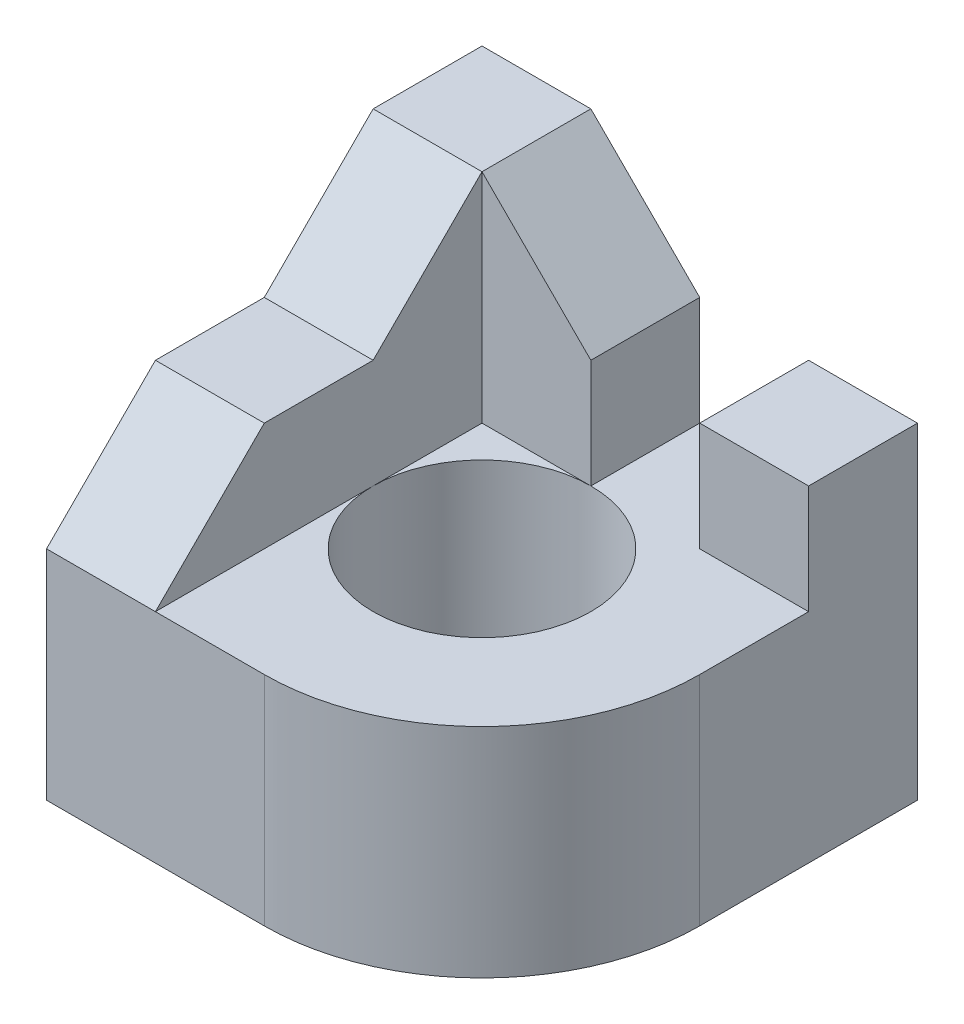
ISO-10303-21;
HEADER;
FILE_DESCRIPTION(('STEP AP214'),'2;1');
FILE_NAME('part.step','',(''),(''),'','','');
FILE_SCHEMA(('AUTOMOTIVE_DESIGN { 1 0 10303 214 1 1 1 1 }'));
ENDSEC;
DATA;
#1=APPLICATION_CONTEXT('core data for automotive mechanical design processes');
#2=APPLICATION_PROTOCOL_DEFINITION('international standard','automotive_design',2000,#1);
#3=PRODUCT_CONTEXT('',#1,'mechanical');
#4=PRODUCT('Part','Part','',(#3));
#5=PRODUCT_RELATED_PRODUCT_CATEGORY('part','',(#4));
#6=PRODUCT_DEFINITION_FORMATION('','',#4);
#7=PRODUCT_DEFINITION_CONTEXT('part definition',#1,'design');
#8=PRODUCT_DEFINITION('design','',#6,#7);
#9=PRODUCT_DEFINITION_SHAPE('','',#8);
#10=(LENGTH_UNIT() NAMED_UNIT(*) SI_UNIT(.MILLI.,.METRE.));
#11=(NAMED_UNIT(*) PLANE_ANGLE_UNIT() SI_UNIT($,.RADIAN.));
#12=(NAMED_UNIT(*) SI_UNIT($,.STERADIAN.) SOLID_ANGLE_UNIT());
#13=UNCERTAINTY_MEASURE_WITH_UNIT(LENGTH_MEASURE(1.E-05),#10,'distance_accuracy_value','');
#14=(GEOMETRIC_REPRESENTATION_CONTEXT(3) GLOBAL_UNCERTAINTY_ASSIGNED_CONTEXT((#13)) GLOBAL_UNIT_ASSIGNED_CONTEXT((#10,
#11,#12)) REPRESENTATION_CONTEXT('',''));
#15=CARTESIAN_POINT('',(0.,0.,0.));
#16=DIRECTION('',(0.,0.,1.));
#17=DIRECTION('',(1.,0.,0.));
#18=AXIS2_PLACEMENT_3D('',#15,#16,#17);
#19=CARTESIAN_POINT('',(0.,40.,0.));
#20=DIRECTION('',(0.,1.,0.));
#21=DIRECTION('',(0.,0.,1.));
#22=AXIS2_PLACEMENT_3D('',#19,#20,#21);
#23=PLANE('',#22);
#24=DIRECTION('',(0.,0.,1.));
#25=VECTOR('',#24,1.);
#26=CARTESIAN_POINT('',(0.,40.,0.));
#27=LINE('',#26,#25);
#28=CARTESIAN_POINT('',(0.,40.,0.));
#29=VERTEX_POINT('',#28);
#30=CARTESIAN_POINT('',(0.,40.,10.));
#31=VERTEX_POINT('',#30);
#32=EDGE_CURVE('E189',#29,#31,#27,.T.);
#33=ORIENTED_EDGE('',*,*,#32,.T.);
#34=DIRECTION('',(-1.,0.,0.));
#35=VECTOR('',#34,1.);
#36=CARTESIAN_POINT('',(109.102540378444,40.,10.));
#37=LINE('',#36,#35);
#38=CARTESIAN_POINT('',(9.99999999999999,40.,10.));
#39=VERTEX_POINT('',#38);
#40=EDGE_CURVE('E161',#39,#31,#37,.T.);
#41=ORIENTED_EDGE('',*,*,#40,.F.);
#42=DIRECTION('',(0.,0.,-1.));
#43=VECTOR('',#42,1.);
#44=CARTESIAN_POINT('',(10.,40.,109.102540378444));
#45=LINE('',#44,#43);
#46=CARTESIAN_POINT('',(10.,40.,0.));
#47=VERTEX_POINT('',#46);
#48=EDGE_CURVE('E185',#39,#47,#45,.T.);
#49=ORIENTED_EDGE('',*,*,#48,.T.);
#50=DIRECTION('',(-1.,0.,0.));
#51=VECTOR('',#50,1.);
#52=CARTESIAN_POINT('',(0.,40.,0.));
#53=LINE('',#52,#51);
#54=EDGE_CURVE('E187',#47,#29,#53,.T.);
#55=ORIENTED_EDGE('',*,*,#54,.T.);
#56=EDGE_LOOP('',(#33,#41,#49,#55));
#57=FACE_BOUND('',#56,.T.);
#58=ADVANCED_FACE('F33',(#57),#23,.T.);
#59=CARTESIAN_POINT('',(0.,20.,40.));
#60=DIRECTION('',(0.,0.,-1.));
#61=DIRECTION('',(-1.,0.,0.));
#62=AXIS2_PLACEMENT_3D('',#59,#60,#61);
#63=PLANE('',#62);
#64=DIRECTION('',(-1.,0.,0.));
#65=VECTOR('',#64,1.);
#66=CARTESIAN_POINT('',(109.102540378444,20.,40.));
#67=LINE('',#66,#65);
#68=CARTESIAN_POINT('',(10.,20.,40.));
#69=VERTEX_POINT('',#68);
#70=CARTESIAN_POINT('',(0.,20.,40.));
#71=VERTEX_POINT('',#70);
#72=EDGE_CURVE('E162',#69,#71,#67,.T.);
#73=ORIENTED_EDGE('',*,*,#72,.T.);
#74=DIRECTION('',(0.,-1.,0.));
#75=VECTOR('',#74,1.);
#76=CARTESIAN_POINT('',(0.,20.,40.));
#77=LINE('',#76,#75);
#78=CARTESIAN_POINT('',(0.,0.,40.));
#79=VERTEX_POINT('',#78);
#80=EDGE_CURVE('E167',#71,#79,#77,.T.);
#81=ORIENTED_EDGE('',*,*,#80,.T.);
#82=DIRECTION('',(1.,0.,0.));
#83=VECTOR('',#82,1.);
#84=CARTESIAN_POINT('',(0.,0.,40.));
#85=LINE('',#84,#83);
#86=CARTESIAN_POINT('',(20.,0.,40.));
#87=VERTEX_POINT('',#86);
#88=EDGE_CURVE('E251',#79,#87,#85,.T.);
#89=ORIENTED_EDGE('',*,*,#88,.T.);
#90=DIRECTION('',(0.,-1.,0.));
#91=VECTOR('',#90,1.);
#92=CARTESIAN_POINT('',(20.,20.,40.));
#93=LINE('',#92,#91);
#94=CARTESIAN_POINT('',(20.,20.,40.));
#95=VERTEX_POINT('',#94);
#96=EDGE_CURVE('E259',#95,#87,#93,.T.);
#97=ORIENTED_EDGE('',*,*,#96,.F.);
#98=DIRECTION('',(1.,0.,0.));
#99=VECTOR('',#98,1.);
#100=CARTESIAN_POINT('',(0.,20.,40.));
#101=LINE('',#100,#99);
#102=EDGE_CURVE('E237',#69,#95,#101,.T.);
#103=ORIENTED_EDGE('',*,*,#102,.F.);
#104=EDGE_LOOP('',(#73,#81,#89,#97,#103));
#105=FACE_BOUND('',#104,.T.);
#106=ADVANCED_FACE('F276',(#105),#63,.F.);
#107=CARTESIAN_POINT('',(9.99999999999999,40.,0.));
#108=DIRECTION('',(1.,0.,0.));
#109=DIRECTION('',(0.,0.,-1.));
#110=AXIS2_PLACEMENT_3D('',#107,#108,#109);
#111=PLANE('',#110);
#112=DIRECTION('',(0.,-1.,0.));
#113=VECTOR('',#112,1.);
#114=CARTESIAN_POINT('',(10.,40.,10.));
#115=LINE('',#114,#113);
#116=CARTESIAN_POINT('',(10.,20.,10.));
#117=VERTEX_POINT('',#116);
#118=EDGE_CURVE('E192',#39,#117,#115,.T.);
#119=ORIENTED_EDGE('',*,*,#118,.F.);
#120=DIRECTION('',(0.,0.707106781186548,-0.707106781186548));
#121=VECTOR('',#120,1.);
#122=CARTESIAN_POINT('',(9.99999999999999,30.,20.));
#123=LINE('',#122,#121);
#124=CARTESIAN_POINT('',(9.99999999999999,30.,20.));
#125=VERTEX_POINT('',#124);
#126=EDGE_CURVE('E176',#125,#39,#123,.T.);
#127=ORIENTED_EDGE('',*,*,#126,.F.);
#128=DIRECTION('',(0.,0.,-1.));
#129=VECTOR('',#128,1.);
#130=CARTESIAN_POINT('',(9.99999999999999,30.,30.));
#131=LINE('',#130,#129);
#132=CARTESIAN_POINT('',(9.99999999999999,30.,30.));
#133=VERTEX_POINT('',#132);
#134=EDGE_CURVE('E178',#133,#125,#131,.T.);
#135=ORIENTED_EDGE('',*,*,#134,.F.);
#136=DIRECTION('',(0.,0.707106781186547,-0.707106781186548));
#137=VECTOR('',#136,1.);
#138=CARTESIAN_POINT('',(9.99999999999999,20.,40.));
#139=LINE('',#138,#137);
#140=EDGE_CURVE('E160',#69,#133,#139,.T.);
#141=ORIENTED_EDGE('',*,*,#140,.F.);
#142=DIRECTION('',(0.,0.,-1.));
#143=VECTOR('',#142,1.);
#144=CARTESIAN_POINT('',(9.99999999999999,20.,0.));
#145=LINE('',#144,#143);
#146=CARTESIAN_POINT('',(10.,20.,20.));
#147=VERTEX_POINT('',#146);
#148=EDGE_CURVE('E200',#69,#147,#145,.T.);
#149=ORIENTED_EDGE('',*,*,#148,.T.);
#150=EDGE_CURVE('E56',#147,#117,#145,.T.);
#151=ORIENTED_EDGE('',*,*,#150,.T.);
#152=EDGE_LOOP('',(#119,#127,#135,#141,#149,#151));
#153=FACE_BOUND('',#152,.T.);
#154=ADVANCED_FACE('F290',(#153),#111,.T.);
#155=CARTESIAN_POINT('',(0.,20.,0.));
#156=DIRECTION('',(0.,0.,1.));
#157=DIRECTION('',(1.,0.,0.));
#158=AXIS2_PLACEMENT_3D('',#155,#156,#157);
#159=PLANE('',#158);
#160=DIRECTION('',(-0.707106781186548,0.707106781186548,0.));
#161=VECTOR('',#160,1.);
#162=CARTESIAN_POINT('',(10.,40.,0.));
#163=LINE('',#162,#161);
#164=CARTESIAN_POINT('',(20.,30.,0.));
#165=VERTEX_POINT('',#164);
#166=EDGE_CURVE('E48',#165,#47,#163,.T.);
#167=ORIENTED_EDGE('',*,*,#166,.F.);
#168=DIRECTION('',(0.,-1.,0.));
#169=VECTOR('',#168,1.);
#170=CARTESIAN_POINT('',(20.,40.,0.));
#171=LINE('',#170,#169);
#172=CARTESIAN_POINT('',(20.,20.,0.));
#173=VERTEX_POINT('',#172);
#174=EDGE_CURVE('E195',#165,#173,#171,.T.);
#175=ORIENTED_EDGE('',*,*,#174,.T.);
#176=DIRECTION('',(-1.,0.,0.));
#177=VECTOR('',#176,1.);
#178=CARTESIAN_POINT('',(0.,20.,0.));
#179=LINE('',#178,#177);
#180=CARTESIAN_POINT('',(30.,20.,0.));
#181=VERTEX_POINT('',#180);
#182=EDGE_CURVE('E233',#181,#173,#179,.T.);
#183=ORIENTED_EDGE('',*,*,#182,.F.);
#184=DIRECTION('',(0.,-1.,0.));
#185=VECTOR('',#184,1.);
#186=CARTESIAN_POINT('',(30.,30.,0.));
#187=LINE('',#186,#185);
#188=CARTESIAN_POINT('',(30.,30.,0.));
#189=VERTEX_POINT('',#188);
#190=EDGE_CURVE('E216',#189,#181,#187,.T.);
#191=ORIENTED_EDGE('',*,*,#190,.F.);
#192=DIRECTION('',(-1.,0.,0.));
#193=VECTOR('',#192,1.);
#194=CARTESIAN_POINT('',(0.,30.,0.));
#195=LINE('',#194,#193);
#196=CARTESIAN_POINT('',(40.,30.,0.));
#197=VERTEX_POINT('',#196);
#198=EDGE_CURVE('E214',#197,#189,#195,.T.);
#199=ORIENTED_EDGE('',*,*,#198,.F.);
#200=DIRECTION('',(0.,-1.,0.));
#201=VECTOR('',#200,1.);
#202=CARTESIAN_POINT('',(40.,20.,0.));
#203=LINE('',#202,#201);
#204=CARTESIAN_POINT('',(40.,0.,0.));
#205=VERTEX_POINT('',#204);
#206=EDGE_CURVE('E11',#197,#205,#203,.T.);
#207=ORIENTED_EDGE('',*,*,#206,.T.);
#208=DIRECTION('',(-1.,0.,0.));
#209=VECTOR('',#208,1.);
#210=CARTESIAN_POINT('',(0.,0.,0.));
#211=LINE('',#210,#209);
#212=CARTESIAN_POINT('',(0.,0.,0.));
#213=VERTEX_POINT('',#212);
#214=EDGE_CURVE('E247',#205,#213,#211,.T.);
#215=ORIENTED_EDGE('',*,*,#214,.T.);
#216=DIRECTION('',(0.,-1.,0.));
#217=VECTOR('',#216,1.);
#218=CARTESIAN_POINT('',(0.,20.,0.));
#219=LINE('',#218,#217);
#220=EDGE_CURVE('E41',#29,#213,#219,.T.);
#221=ORIENTED_EDGE('',*,*,#220,.F.);
#222=ORIENTED_EDGE('',*,*,#54,.F.);
#223=EDGE_LOOP('',(#167,#175,#183,#191,#199,#207,#215,#221,#222));
#224=FACE_BOUND('',#223,.T.);
#225=ADVANCED_FACE('F305',(#224),#159,.F.);
#226=CARTESIAN_POINT('',(0.,40.,10.));
#227=DIRECTION('',(0.,0.,-1.));
#228=DIRECTION('',(-1.,0.,0.));
#229=AXIS2_PLACEMENT_3D('',#226,#227,#228);
#230=PLANE('',#229);
#231=DIRECTION('',(-0.707106781186548,0.707106781186548,0.));
#232=VECTOR('',#231,1.);
#233=CARTESIAN_POINT('',(10.,40.,10.));
#234=LINE('',#233,#232);
#235=CARTESIAN_POINT('',(20.,30.,10.));
#236=VERTEX_POINT('',#235);
#237=EDGE_CURVE('E181',#236,#39,#234,.T.);
#238=ORIENTED_EDGE('',*,*,#237,.T.);
#239=ORIENTED_EDGE('',*,*,#118,.T.);
#240=DIRECTION('',(-1.,0.,0.));
#241=VECTOR('',#240,1.);
#242=CARTESIAN_POINT('',(0.,20.,10.));
#243=LINE('',#242,#241);
#244=CARTESIAN_POINT('',(20.,20.,10.));
#245=VERTEX_POINT('',#244);
#246=EDGE_CURVE('E204',#245,#117,#243,.T.);
#247=ORIENTED_EDGE('',*,*,#246,.F.);
#248=DIRECTION('',(0.,-1.,0.));
#249=VECTOR('',#248,1.);
#250=CARTESIAN_POINT('',(20.,40.,10.));
#251=LINE('',#250,#249);
#252=EDGE_CURVE('E197',#236,#245,#251,.T.);
#253=ORIENTED_EDGE('',*,*,#252,.F.);
#254=EDGE_LOOP('',(#238,#239,#247,#253));
#255=FACE_BOUND('',#254,.T.);
#256=ADVANCED_FACE('F297',(#255),#230,.F.);
#257=CARTESIAN_POINT('',(20.,40.,0.));
#258=DIRECTION('',(-1.,0.,0.));
#259=DIRECTION('',(0.,0.,1.));
#260=AXIS2_PLACEMENT_3D('',#257,#258,#259);
#261=PLANE('',#260);
#262=DIRECTION('',(0.,0.,-1.));
#263=VECTOR('',#262,1.);
#264=CARTESIAN_POINT('',(20.,30.,109.102540378444));
#265=LINE('',#264,#263);
#266=EDGE_CURVE('E180',#236,#165,#265,.T.);
#267=ORIENTED_EDGE('',*,*,#266,.F.);
#268=ORIENTED_EDGE('',*,*,#252,.T.);
#269=DIRECTION('',(0.,0.,1.));
#270=VECTOR('',#269,1.);
#271=CARTESIAN_POINT('',(20.,20.,0.));
#272=LINE('',#271,#270);
#273=EDGE_CURVE('E201',#173,#245,#272,.T.);
#274=ORIENTED_EDGE('',*,*,#273,.F.);
#275=ORIENTED_EDGE('',*,*,#174,.F.);
#276=EDGE_LOOP('',(#267,#268,#274,#275));
#277=FACE_BOUND('',#276,.T.);
#278=ADVANCED_FACE('F303',(#277),#261,.F.);
#279=CARTESIAN_POINT('',(0.,20.,0.));
#280=DIRECTION('',(0.,1.,0.));
#281=DIRECTION('',(0.,0.,1.));
#282=AXIS2_PLACEMENT_3D('',#279,#280,#281);
#283=PLANE('',#282);
#284=ORIENTED_EDGE('',*,*,#182,.T.);
#285=ORIENTED_EDGE('',*,*,#273,.T.);
#286=CARTESIAN_POINT('',(20.,20.,20.));
#287=DIRECTION('',(0.,1.,0.));
#288=DIRECTION('',(0.,0.,1.));
#289=AXIS2_PLACEMENT_3D('',#286,#287,#288);
#290=CIRCLE('',#289,10.);
#291=EDGE_CURVE('E241',#147,#245,#290,.T.);
#292=ORIENTED_EDGE('',*,*,#291,.F.);
#293=ORIENTED_EDGE('',*,*,#148,.F.);
#294=ORIENTED_EDGE('',*,*,#102,.T.);
#295=CARTESIAN_POINT('',(20.,20.,20.));
#296=DIRECTION('',(0.,1.,0.));
#297=DIRECTION('',(0.,0.,1.));
#298=AXIS2_PLACEMENT_3D('',#295,#296,#297);
#299=CIRCLE('',#298,20.);
#300=CARTESIAN_POINT('',(40.,20.,20.));
#301=VERTEX_POINT('',#300);
#302=EDGE_CURVE('E239',#95,#301,#299,.T.);
#303=ORIENTED_EDGE('',*,*,#302,.T.);
#304=DIRECTION('',(0.,0.,-1.));
#305=VECTOR('',#304,1.);
#306=CARTESIAN_POINT('',(40.,20.,0.));
#307=LINE('',#306,#305);
#308=CARTESIAN_POINT('',(40.,20.,10.));
#309=VERTEX_POINT('',#308);
#310=EDGE_CURVE('E231',#301,#309,#307,.T.);
#311=ORIENTED_EDGE('',*,*,#310,.T.);
#312=DIRECTION('',(-1.,0.,0.));
#313=VECTOR('',#312,1.);
#314=CARTESIAN_POINT('',(0.,20.,10.));
#315=LINE('',#314,#313);
#316=CARTESIAN_POINT('',(30.,20.,10.));
#317=VERTEX_POINT('',#316);
#318=EDGE_CURVE('E225',#309,#317,#315,.T.);
#319=ORIENTED_EDGE('',*,*,#318,.T.);
#320=DIRECTION('',(0.,0.,1.));
#321=VECTOR('',#320,1.);
#322=CARTESIAN_POINT('',(30.,20.,0.));
#323=LINE('',#322,#321);
#324=EDGE_CURVE('E227',#181,#317,#323,.T.);
#325=ORIENTED_EDGE('',*,*,#324,.F.);
#326=EDGE_LOOP('',(#284,#285,#292,#293,#294,#303,#311,#319,#325));
#327=FACE_BOUND('',#326,.T.);
#328=ADVANCED_FACE('F284',(#327),#283,.T.);
#329=EDGE_CURVE('E242',#245,#147,#290,.T.);
#330=ORIENTED_EDGE('',*,*,#329,.F.);
#331=ORIENTED_EDGE('',*,*,#246,.T.);
#332=ORIENTED_EDGE('',*,*,#150,.F.);
#333=EDGE_LOOP('',(#330,#331,#332));
#334=FACE_BOUND('',#333,.T.);
#335=ADVANCED_FACE('F362',(#334),#283,.T.);
#336=CARTESIAN_POINT('',(40.,20.,0.));
#337=DIRECTION('',(-1.,0.,0.));
#338=DIRECTION('',(0.,0.,1.));
#339=AXIS2_PLACEMENT_3D('',#336,#337,#338);
#340=PLANE('',#339);
#341=ORIENTED_EDGE('',*,*,#206,.F.);
#342=DIRECTION('',(0.,0.,-1.));
#343=VECTOR('',#342,1.);
#344=CARTESIAN_POINT('',(40.,30.,0.));
#345=LINE('',#344,#343);
#346=CARTESIAN_POINT('',(40.,30.,10.));
#347=VERTEX_POINT('',#346);
#348=EDGE_CURVE('E211',#347,#197,#345,.T.);
#349=ORIENTED_EDGE('',*,*,#348,.F.);
#350=DIRECTION('',(0.,-1.,0.));
#351=VECTOR('',#350,1.);
#352=CARTESIAN_POINT('',(40.,30.,10.));
#353=LINE('',#352,#351);
#354=EDGE_CURVE('E219',#347,#309,#353,.T.);
#355=ORIENTED_EDGE('',*,*,#354,.T.);
#356=ORIENTED_EDGE('',*,*,#310,.F.);
#357=DIRECTION('',(0.,-1.,0.));
#358=VECTOR('',#357,1.);
#359=CARTESIAN_POINT('',(40.,20.,20.));
#360=LINE('',#359,#358);
#361=CARTESIAN_POINT('',(40.,0.,20.));
#362=VERTEX_POINT('',#361);
#363=EDGE_CURVE('E245',#301,#362,#360,.T.);
#364=ORIENTED_EDGE('',*,*,#363,.T.);
#365=DIRECTION('',(0.,0.,-1.));
#366=VECTOR('',#365,1.);
#367=CARTESIAN_POINT('',(40.,0.,0.));
#368=LINE('',#367,#366);
#369=EDGE_CURVE('E230',#362,#205,#368,.T.);
#370=ORIENTED_EDGE('',*,*,#369,.T.);
#371=EDGE_LOOP('',(#341,#349,#355,#356,#364,#370));
#372=FACE_BOUND('',#371,.T.);
#373=ADVANCED_FACE('F35',(#372),#340,.F.);
#374=CARTESIAN_POINT('',(0.,20.,0.));
#375=DIRECTION('',(1.,0.,0.));
#376=DIRECTION('',(0.,0.,-1.));
#377=AXIS2_PLACEMENT_3D('',#374,#375,#376);
#378=PLANE('',#377);
#379=ORIENTED_EDGE('',*,*,#80,.F.);
#380=DIRECTION('',(0.,0.707106781186547,-0.707106781186548));
#381=VECTOR('',#380,1.);
#382=CARTESIAN_POINT('',(0.,20.,40.));
#383=LINE('',#382,#381);
#384=CARTESIAN_POINT('',(0.,30.,30.));
#385=VERTEX_POINT('',#384);
#386=EDGE_CURVE('E154',#71,#385,#383,.T.);
#387=ORIENTED_EDGE('',*,*,#386,.T.);
#388=DIRECTION('',(0.,0.,-1.));
#389=VECTOR('',#388,1.);
#390=CARTESIAN_POINT('',(0.,30.,30.));
#391=LINE('',#390,#389);
#392=CARTESIAN_POINT('',(0.,30.,20.));
#393=VERTEX_POINT('',#392);
#394=EDGE_CURVE('E143',#385,#393,#391,.T.);
#395=ORIENTED_EDGE('',*,*,#394,.T.);
#396=DIRECTION('',(0.,0.707106781186548,-0.707106781186548));
#397=VECTOR('',#396,1.);
#398=CARTESIAN_POINT('',(0.,30.,20.));
#399=LINE('',#398,#397);
#400=EDGE_CURVE('E153',#393,#31,#399,.T.);
#401=ORIENTED_EDGE('',*,*,#400,.T.);
#402=ORIENTED_EDGE('',*,*,#32,.F.);
#403=ORIENTED_EDGE('',*,*,#220,.T.);
#404=DIRECTION('',(0.,0.,1.));
#405=VECTOR('',#404,1.);
#406=CARTESIAN_POINT('',(0.,0.,0.));
#407=LINE('',#406,#405);
#408=EDGE_CURVE('E249',#213,#79,#407,.T.);
#409=ORIENTED_EDGE('',*,*,#408,.T.);
#410=EDGE_LOOP('',(#379,#387,#395,#401,#402,#403,#409));
#411=FACE_BOUND('',#410,.T.);
#412=ADVANCED_FACE('F165',(#411),#378,.F.);
#413=CARTESIAN_POINT('',(20.,20.,20.));
#414=DIRECTION('',(0.,-1.,0.));
#415=DIRECTION('',(0.,0.,-1.));
#416=AXIS2_PLACEMENT_3D('',#413,#414,#415);
#417=CYLINDRICAL_SURFACE('',#416,20.);
#418=CARTESIAN_POINT('',(20.,0.,20.));
#419=DIRECTION('',(0.,1.,0.));
#420=DIRECTION('',(0.,0.,1.));
#421=AXIS2_PLACEMENT_3D('',#418,#419,#420);
#422=CIRCLE('',#421,20.);
#423=EDGE_CURVE('E253',#87,#362,#422,.T.);
#424=ORIENTED_EDGE('',*,*,#423,.T.);
#425=ORIENTED_EDGE('',*,*,#363,.F.);
#426=ORIENTED_EDGE('',*,*,#302,.F.);
#427=ORIENTED_EDGE('',*,*,#96,.T.);
#428=EDGE_LOOP('',(#424,#425,#426,#427));
#429=FACE_BOUND('',#428,.T.);
#430=ADVANCED_FACE('F280',(#429),#417,.T.);
#431=CARTESIAN_POINT('',(20.,20.,20.));
#432=DIRECTION('',(0.,-1.,0.));
#433=DIRECTION('',(0.,0.,-1.));
#434=AXIS2_PLACEMENT_3D('',#431,#432,#433);
#435=CYLINDRICAL_SURFACE('',#434,10.);
#436=CARTESIAN_POINT('',(20.,0.,20.));
#437=DIRECTION('',(0.,1.,0.));
#438=DIRECTION('',(0.,0.,1.));
#439=AXIS2_PLACEMENT_3D('',#436,#437,#438);
#440=CIRCLE('',#439,10.);
#441=CARTESIAN_POINT('',(20.,0.,30.));
#442=VERTEX_POINT('',#441);
#443=EDGE_CURVE('E234',#442,#442,#440,.T.);
#444=ORIENTED_EDGE('',*,*,#443,.F.);
#445=EDGE_LOOP('',(#444));
#446=FACE_BOUND('',#445,.T.);
#447=ORIENTED_EDGE('',*,*,#291,.T.);
#448=ORIENTED_EDGE('',*,*,#329,.T.);
#449=EDGE_LOOP('',(#447,#448));
#450=FACE_BOUND('',#449,.T.);
#451=ADVANCED_FACE('F354',(#446,#450),#435,.F.);
#452=CARTESIAN_POINT('',(0.,0.,0.));
#453=DIRECTION('',(0.,1.,0.));
#454=DIRECTION('',(0.,0.,1.));
#455=AXIS2_PLACEMENT_3D('',#452,#453,#454);
#456=PLANE('',#455);
#457=ORIENTED_EDGE('',*,*,#443,.T.);
#458=EDGE_LOOP('',(#457));
#459=FACE_BOUND('',#458,.T.);
#460=ORIENTED_EDGE('',*,*,#408,.F.);
#461=ORIENTED_EDGE('',*,*,#214,.F.);
#462=ORIENTED_EDGE('',*,*,#369,.F.);
#463=ORIENTED_EDGE('',*,*,#423,.F.);
#464=ORIENTED_EDGE('',*,*,#88,.F.);
#465=EDGE_LOOP('',(#460,#461,#462,#463,#464));
#466=FACE_BOUND('',#465,.T.);
#467=ADVANCED_FACE('F271',(#459,#466),#456,.F.);
#468=CARTESIAN_POINT('',(30.,30.,0.));
#469=DIRECTION('',(-1.,0.,0.));
#470=DIRECTION('',(0.,0.,1.));
#471=AXIS2_PLACEMENT_3D('',#468,#469,#470);
#472=PLANE('',#471);
#473=ORIENTED_EDGE('',*,*,#190,.T.);
#474=ORIENTED_EDGE('',*,*,#324,.T.);
#475=DIRECTION('',(0.,-1.,0.));
#476=VECTOR('',#475,1.);
#477=CARTESIAN_POINT('',(30.,30.,10.));
#478=LINE('',#477,#476);
#479=CARTESIAN_POINT('',(30.,30.,10.));
#480=VERTEX_POINT('',#479);
#481=EDGE_CURVE('E222',#480,#317,#478,.T.);
#482=ORIENTED_EDGE('',*,*,#481,.F.);
#483=DIRECTION('',(0.,0.,-1.));
#484=VECTOR('',#483,1.);
#485=CARTESIAN_POINT('',(30.,30.,0.));
#486=LINE('',#485,#484);
#487=EDGE_CURVE('E206',#480,#189,#486,.T.);
#488=ORIENTED_EDGE('',*,*,#487,.T.);
#489=EDGE_LOOP('',(#473,#474,#482,#488));
#490=FACE_BOUND('',#489,.T.);
#491=ADVANCED_FACE('F310',(#490),#472,.T.);
#492=CARTESIAN_POINT('',(0.,30.,10.));
#493=DIRECTION('',(0.,0.,-1.));
#494=DIRECTION('',(-1.,0.,0.));
#495=AXIS2_PLACEMENT_3D('',#492,#493,#494);
#496=PLANE('',#495);
#497=ORIENTED_EDGE('',*,*,#318,.F.);
#498=ORIENTED_EDGE('',*,*,#354,.F.);
#499=DIRECTION('',(1.,0.,0.));
#500=VECTOR('',#499,1.);
#501=CARTESIAN_POINT('',(0.,30.,10.));
#502=LINE('',#501,#500);
#503=EDGE_CURVE('E209',#480,#347,#502,.T.);
#504=ORIENTED_EDGE('',*,*,#503,.F.);
#505=ORIENTED_EDGE('',*,*,#481,.T.);
#506=EDGE_LOOP('',(#497,#498,#504,#505));
#507=FACE_BOUND('',#506,.T.);
#508=ADVANCED_FACE('F320',(#507),#496,.F.);
#509=CARTESIAN_POINT('',(0.,30.,0.));
#510=DIRECTION('',(0.,1.,0.));
#511=DIRECTION('',(0.,0.,1.));
#512=AXIS2_PLACEMENT_3D('',#509,#510,#511);
#513=PLANE('',#512);
#514=ORIENTED_EDGE('',*,*,#487,.F.);
#515=ORIENTED_EDGE('',*,*,#503,.T.);
#516=ORIENTED_EDGE('',*,*,#348,.T.);
#517=ORIENTED_EDGE('',*,*,#198,.T.);
#518=EDGE_LOOP('',(#514,#515,#516,#517));
#519=FACE_BOUND('',#518,.T.);
#520=ADVANCED_FACE('F314',(#519),#513,.T.);
#521=CARTESIAN_POINT('',(10.,40.,109.102540378444));
#522=DIRECTION('',(0.707106781186548,0.707106781186548,0.));
#523=DIRECTION('',(-0.707106781186548,0.707106781186548,0.));
#524=AXIS2_PLACEMENT_3D('',#521,#522,#523);
#525=PLANE('',#524);
#526=ORIENTED_EDGE('',*,*,#237,.F.);
#527=ORIENTED_EDGE('',*,*,#266,.T.);
#528=ORIENTED_EDGE('',*,*,#166,.T.);
#529=ORIENTED_EDGE('',*,*,#48,.F.);
#530=EDGE_LOOP('',(#526,#527,#528,#529));
#531=FACE_BOUND('',#530,.T.);
#532=ADVANCED_FACE('F300',(#531),#525,.T.);
#533=CARTESIAN_POINT('',(109.102540378444,30.,20.));
#534=DIRECTION('',(0.,0.707106781186548,0.707106781186548));
#535=DIRECTION('',(0.,-0.707106781186548,0.707106781186548));
#536=AXIS2_PLACEMENT_3D('',#533,#534,#535);
#537=PLANE('',#536);
#538=DIRECTION('',(-1.,0.,0.));
#539=VECTOR('',#538,1.);
#540=CARTESIAN_POINT('',(109.102540378444,30.,20.));
#541=LINE('',#540,#539);
#542=EDGE_CURVE('E149',#125,#393,#541,.T.);
#543=ORIENTED_EDGE('',*,*,#542,.F.);
#544=ORIENTED_EDGE('',*,*,#126,.T.);
#545=ORIENTED_EDGE('',*,*,#40,.T.);
#546=ORIENTED_EDGE('',*,*,#400,.F.);
#547=EDGE_LOOP('',(#543,#544,#545,#546));
#548=FACE_BOUND('',#547,.T.);
#549=ADVANCED_FACE('F293',(#548),#537,.T.);
#550=CARTESIAN_POINT('',(109.102540378444,30.,30.));
#551=DIRECTION('',(0.,1.,0.));
#552=DIRECTION('',(0.,0.,1.));
#553=AXIS2_PLACEMENT_3D('',#550,#551,#552);
#554=PLANE('',#553);
#555=DIRECTION('',(-1.,0.,0.));
#556=VECTOR('',#555,1.);
#557=CARTESIAN_POINT('',(109.102540378444,30.,30.));
#558=LINE('',#557,#556);
#559=EDGE_CURVE('E146',#133,#385,#558,.T.);
#560=ORIENTED_EDGE('',*,*,#559,.F.);
#561=ORIENTED_EDGE('',*,*,#134,.T.);
#562=ORIENTED_EDGE('',*,*,#542,.T.);
#563=ORIENTED_EDGE('',*,*,#394,.F.);
#564=EDGE_LOOP('',(#560,#561,#562,#563));
#565=FACE_BOUND('',#564,.T.);
#566=ADVANCED_FACE('F145',(#565),#554,.T.);
#567=CARTESIAN_POINT('',(109.102540378444,20.,40.));
#568=DIRECTION('',(0.,0.707106781186548,0.707106781186547));
#569=DIRECTION('',(0.,-0.707106781186547,0.707106781186548));
#570=AXIS2_PLACEMENT_3D('',#567,#568,#569);
#571=PLANE('',#570);
#572=ORIENTED_EDGE('',*,*,#72,.F.);
#573=ORIENTED_EDGE('',*,*,#140,.T.);
#574=ORIENTED_EDGE('',*,*,#559,.T.);
#575=ORIENTED_EDGE('',*,*,#386,.F.);
#576=EDGE_LOOP('',(#572,#573,#574,#575));
#577=FACE_BOUND('',#576,.T.);
#578=ADVANCED_FACE('F157',(#577),#571,.T.);
#579=CLOSED_SHELL('',(#58,#106,#154,#225,#256,#278,#328,#335,#373,#412,#430,#451,#467,#491,#508,
#520,#532,#549,#566,#578));
#580=MANIFOLD_SOLID_BREP('B2',#579);
#581=ADVANCED_BREP_SHAPE_REPRESENTATION('',(#18,#580),#14);
#582=SHAPE_DEFINITION_REPRESENTATION(#9,#581);
ENDSEC;
END-ISO-10303-21;
